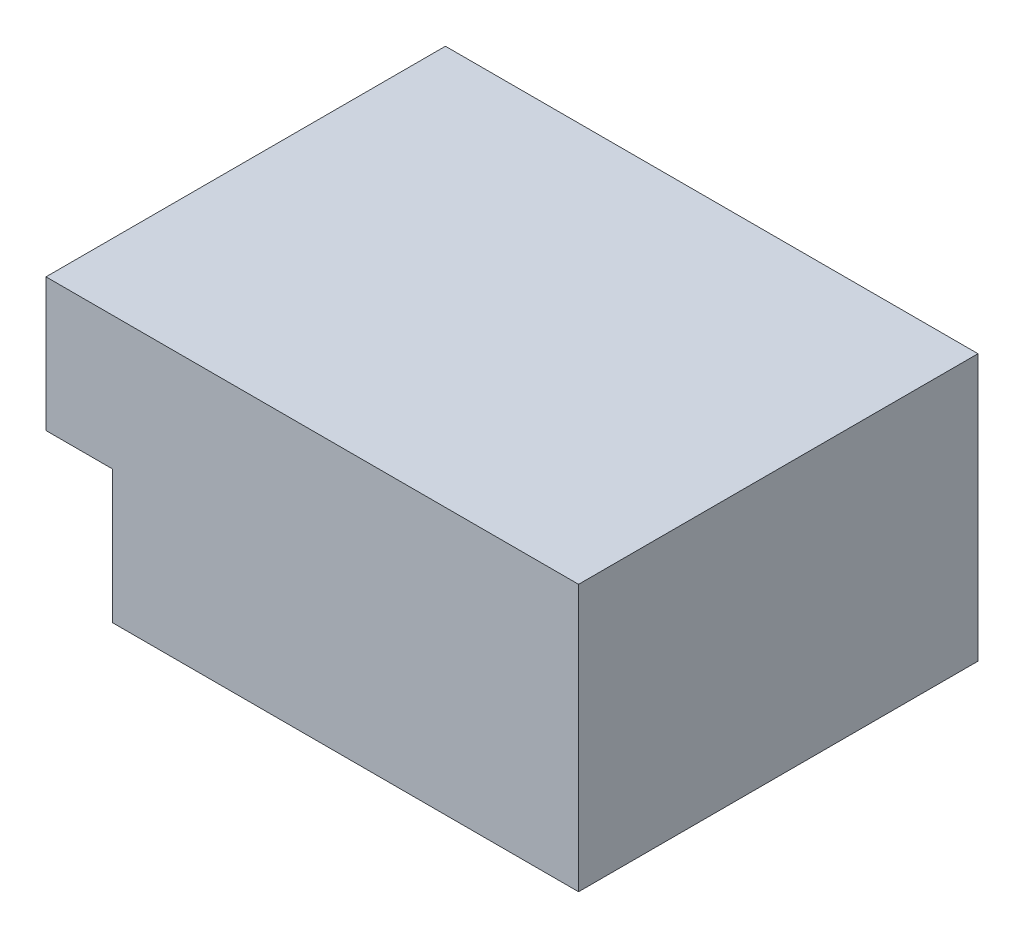
ISO-10303-21;
HEADER;
FILE_DESCRIPTION(('STEP AP214'),'2;1');
FILE_NAME('part.step','',(''),(''),'','','');
FILE_SCHEMA(('AUTOMOTIVE_DESIGN { 1 0 10303 214 1 1 1 1 }'));
ENDSEC;
DATA;
#1=APPLICATION_CONTEXT('core data for automotive mechanical design processes');
#2=APPLICATION_PROTOCOL_DEFINITION('international standard','automotive_design',2000,#1);
#3=PRODUCT_CONTEXT('',#1,'mechanical');
#4=PRODUCT('Part','Part','',(#3));
#5=PRODUCT_RELATED_PRODUCT_CATEGORY('part','',(#4));
#6=PRODUCT_DEFINITION_FORMATION('','',#4);
#7=PRODUCT_DEFINITION_CONTEXT('part definition',#1,'design');
#8=PRODUCT_DEFINITION('design','',#6,#7);
#9=PRODUCT_DEFINITION_SHAPE('','',#8);
#10=(LENGTH_UNIT() NAMED_UNIT(*) SI_UNIT(.MILLI.,.METRE.));
#11=(NAMED_UNIT(*) PLANE_ANGLE_UNIT() SI_UNIT($,.RADIAN.));
#12=(NAMED_UNIT(*) SI_UNIT($,.STERADIAN.) SOLID_ANGLE_UNIT());
#13=UNCERTAINTY_MEASURE_WITH_UNIT(LENGTH_MEASURE(1.E-05),#10,'distance_accuracy_value','');
#14=(GEOMETRIC_REPRESENTATION_CONTEXT(3) GLOBAL_UNCERTAINTY_ASSIGNED_CONTEXT((#13)) GLOBAL_UNIT_ASSIGNED_CONTEXT((#10,
#11,#12)) REPRESENTATION_CONTEXT('',''));
#15=CARTESIAN_POINT('',(0.,0.,0.));
#16=DIRECTION('',(0.,0.,1.));
#17=DIRECTION('',(1.,0.,0.));
#18=AXIS2_PLACEMENT_3D('',#15,#16,#17);
#19=CARTESIAN_POINT('',(0.,0.,0.));
#20=DIRECTION('',(0.,-1.,0.));
#21=DIRECTION('',(-1.,0.,0.));
#22=AXIS2_PLACEMENT_3D('',#19,#20,#21);
#23=PLANE('',#22);
#24=DIRECTION('',(0.,0.,-1.));
#25=VECTOR('',#24,1.);
#26=CARTESIAN_POINT('',(-1.95,0.,-0.25));
#27=LINE('',#26,#25);
#28=CARTESIAN_POINT('',(-1.95,0.,-0.25));
#29=VERTEX_POINT('',#28);
#30=CARTESIAN_POINT('',(-1.95,0.,-0.55));
#31=VERTEX_POINT('',#30);
#32=EDGE_CURVE('E11',#29,#31,#27,.T.);
#33=ORIENTED_EDGE('',*,*,#32,.T.);
#34=DIRECTION('',(1.,0.,0.));
#35=VECTOR('',#34,1.);
#36=CARTESIAN_POINT('',(-1.95,0.,-0.55));
#37=LINE('',#36,#35);
#38=CARTESIAN_POINT('',(-1.6,0.,-0.55));
#39=VERTEX_POINT('',#38);
#40=EDGE_CURVE('E115',#31,#39,#37,.T.);
#41=ORIENTED_EDGE('',*,*,#40,.T.);
#42=DIRECTION('',(0.,0.,-1.));
#43=VECTOR('',#42,1.);
#44=CARTESIAN_POINT('',(-1.6,0.,-0.25));
#45=LINE('',#44,#43);
#46=CARTESIAN_POINT('',(-1.6,0.,-0.25));
#47=VERTEX_POINT('',#46);
#48=EDGE_CURVE('E109',#47,#39,#45,.T.);
#49=ORIENTED_EDGE('',*,*,#48,.F.);
#50=DIRECTION('',(-1.,0.,0.));
#51=VECTOR('',#50,1.);
#52=CARTESIAN_POINT('',(-1.6,0.,-0.25));
#53=LINE('',#52,#51);
#54=EDGE_CURVE('E101',#47,#29,#53,.T.);
#55=ORIENTED_EDGE('',*,*,#54,.T.);
#56=EDGE_LOOP('',(#33,#41,#49,#55));
#57=FACE_BOUND('',#56,.T.);
#58=ADVANCED_FACE('F17',(#57),#23,.T.);
#59=CARTESIAN_POINT('',(-1.75,0.,-0.25));
#60=DIRECTION('',(0.,0.,-1.));
#61=DIRECTION('',(-1.,0.,0.));
#62=AXIS2_PLACEMENT_3D('',#59,#60,#61);
#63=PLANE('',#62);
#64=DIRECTION('',(0.,1.,0.));
#65=VECTOR('',#64,1.);
#66=CARTESIAN_POINT('',(-2.,0.1,-0.25));
#67=LINE('',#66,#65);
#68=CARTESIAN_POINT('',(-2.,0.1,-0.25));
#69=VERTEX_POINT('',#68);
#70=CARTESIAN_POINT('',(-2.,0.2,-0.25));
#71=VERTEX_POINT('',#70);
#72=EDGE_CURVE('E24',#69,#71,#67,.T.);
#73=ORIENTED_EDGE('',*,*,#72,.F.);
#74=DIRECTION('',(1.,0.,0.));
#75=VECTOR('',#74,1.);
#76=CARTESIAN_POINT('',(-2.,0.1,-0.25));
#77=LINE('',#76,#75);
#78=CARTESIAN_POINT('',(-1.95,0.1,-0.25));
#79=VERTEX_POINT('',#78);
#80=EDGE_CURVE('E85',#69,#79,#77,.T.);
#81=ORIENTED_EDGE('',*,*,#80,.T.);
#82=DIRECTION('',(0.,1.,0.));
#83=VECTOR('',#82,1.);
#84=CARTESIAN_POINT('',(-1.95,0.,-0.25));
#85=LINE('',#84,#83);
#86=EDGE_CURVE('E103',#29,#79,#85,.T.);
#87=ORIENTED_EDGE('',*,*,#86,.F.);
#88=ORIENTED_EDGE('',*,*,#54,.F.);
#89=DIRECTION('',(0.,1.,0.));
#90=VECTOR('',#89,1.);
#91=CARTESIAN_POINT('',(-1.6,0.,-0.25));
#92=LINE('',#91,#90);
#93=CARTESIAN_POINT('',(-1.6,0.2,-0.25));
#94=VERTEX_POINT('',#93);
#95=EDGE_CURVE('E80',#47,#94,#92,.T.);
#96=ORIENTED_EDGE('',*,*,#95,.T.);
#97=DIRECTION('',(-1.,0.,0.));
#98=VECTOR('',#97,1.);
#99=CARTESIAN_POINT('',(-1.6,0.2,-0.25));
#100=LINE('',#99,#98);
#101=EDGE_CURVE('E79',#94,#71,#100,.T.);
#102=ORIENTED_EDGE('',*,*,#101,.T.);
#103=EDGE_LOOP('',(#73,#81,#87,#88,#96,#102));
#104=FACE_BOUND('',#103,.T.);
#105=ADVANCED_FACE('F117',(#104),#63,.F.);
#106=CARTESIAN_POINT('',(0.,0.2,0.));
#107=DIRECTION('',(0.,-1.,0.));
#108=DIRECTION('',(-1.,0.,0.));
#109=AXIS2_PLACEMENT_3D('',#106,#107,#108);
#110=PLANE('',#109);
#111=DIRECTION('',(1.,0.,0.));
#112=VECTOR('',#111,1.);
#113=CARTESIAN_POINT('',(-2.,0.2,-0.55));
#114=LINE('',#113,#112);
#115=CARTESIAN_POINT('',(-2.,0.2,-0.55));
#116=VERTEX_POINT('',#115);
#117=CARTESIAN_POINT('',(-1.6,0.2,-0.55));
#118=VERTEX_POINT('',#117);
#119=EDGE_CURVE('E113',#116,#118,#114,.T.);
#120=ORIENTED_EDGE('',*,*,#119,.F.);
#121=DIRECTION('',(0.,0.,-1.));
#122=VECTOR('',#121,1.);
#123=CARTESIAN_POINT('',(-2.,0.2,-0.25));
#124=LINE('',#123,#122);
#125=EDGE_CURVE('E91',#71,#116,#124,.T.);
#126=ORIENTED_EDGE('',*,*,#125,.F.);
#127=ORIENTED_EDGE('',*,*,#101,.F.);
#128=DIRECTION('',(0.,0.,1.));
#129=VECTOR('',#128,1.);
#130=CARTESIAN_POINT('',(-1.6,0.2,-0.55));
#131=LINE('',#130,#129);
#132=EDGE_CURVE('E98',#118,#94,#131,.T.);
#133=ORIENTED_EDGE('',*,*,#132,.F.);
#134=EDGE_LOOP('',(#120,#126,#127,#133));
#135=FACE_BOUND('',#134,.T.);
#136=ADVANCED_FACE('F122',(#135),#110,.F.);
#137=CARTESIAN_POINT('',(-1.6,0.,-0.25));
#138=DIRECTION('',(1.,0.,0.));
#139=DIRECTION('',(0.,0.,-1.));
#140=AXIS2_PLACEMENT_3D('',#137,#138,#139);
#141=PLANE('',#140);
#142=DIRECTION('',(0.,1.,0.));
#143=VECTOR('',#142,1.);
#144=CARTESIAN_POINT('',(-1.6,0.,-0.55));
#145=LINE('',#144,#143);
#146=EDGE_CURVE('E107',#39,#118,#145,.T.);
#147=ORIENTED_EDGE('',*,*,#146,.T.);
#148=ORIENTED_EDGE('',*,*,#132,.T.);
#149=ORIENTED_EDGE('',*,*,#95,.F.);
#150=ORIENTED_EDGE('',*,*,#48,.T.);
#151=EDGE_LOOP('',(#147,#148,#149,#150));
#152=FACE_BOUND('',#151,.T.);
#153=ADVANCED_FACE('F125',(#152),#141,.T.);
#154=CARTESIAN_POINT('',(-2.,0.,-0.55));
#155=DIRECTION('',(0.,0.,1.));
#156=DIRECTION('',(1.,0.,0.));
#157=AXIS2_PLACEMENT_3D('',#154,#155,#156);
#158=PLANE('',#157);
#159=DIRECTION('',(0.,1.,0.));
#160=VECTOR('',#159,1.);
#161=CARTESIAN_POINT('',(-1.95,0.,-0.55));
#162=LINE('',#161,#160);
#163=CARTESIAN_POINT('',(-1.95,0.1,-0.55));
#164=VERTEX_POINT('',#163);
#165=EDGE_CURVE('E75',#31,#164,#162,.T.);
#166=ORIENTED_EDGE('',*,*,#165,.T.);
#167=DIRECTION('',(1.,0.,0.));
#168=VECTOR('',#167,1.);
#169=CARTESIAN_POINT('',(-2.,0.1,-0.55));
#170=LINE('',#169,#168);
#171=CARTESIAN_POINT('',(-2.,0.1,-0.55));
#172=VERTEX_POINT('',#171);
#173=EDGE_CURVE('E68',#172,#164,#170,.T.);
#174=ORIENTED_EDGE('',*,*,#173,.F.);
#175=DIRECTION('',(0.,1.,0.));
#176=VECTOR('',#175,1.);
#177=CARTESIAN_POINT('',(-2.,0.1,-0.55));
#178=LINE('',#177,#176);
#179=EDGE_CURVE('E73',#172,#116,#178,.T.);
#180=ORIENTED_EDGE('',*,*,#179,.T.);
#181=ORIENTED_EDGE('',*,*,#119,.T.);
#182=ORIENTED_EDGE('',*,*,#146,.F.);
#183=ORIENTED_EDGE('',*,*,#40,.F.);
#184=EDGE_LOOP('',(#166,#174,#180,#181,#182,#183));
#185=FACE_BOUND('',#184,.T.);
#186=ADVANCED_FACE('F70',(#185),#158,.F.);
#187=CARTESIAN_POINT('',(-2.,0.,-0.25));
#188=DIRECTION('',(1.,0.,0.));
#189=DIRECTION('',(0.,0.,-1.));
#190=AXIS2_PLACEMENT_3D('',#187,#188,#189);
#191=PLANE('',#190);
#192=ORIENTED_EDGE('',*,*,#72,.T.);
#193=ORIENTED_EDGE('',*,*,#125,.T.);
#194=ORIENTED_EDGE('',*,*,#179,.F.);
#195=DIRECTION('',(0.,0.,-1.));
#196=VECTOR('',#195,1.);
#197=CARTESIAN_POINT('',(-2.,0.1,-0.25));
#198=LINE('',#197,#196);
#199=EDGE_CURVE('E83',#69,#172,#198,.T.);
#200=ORIENTED_EDGE('',*,*,#199,.F.);
#201=EDGE_LOOP('',(#192,#193,#194,#200));
#202=FACE_BOUND('',#201,.T.);
#203=ADVANCED_FACE('F90',(#202),#191,.F.);
#204=CARTESIAN_POINT('',(-2.,0.1,-1.92));
#205=DIRECTION('',(0.,-1.,0.));
#206=DIRECTION('',(1.,0.,0.));
#207=AXIS2_PLACEMENT_3D('',#204,#205,#206);
#208=PLANE('',#207);
#209=ORIENTED_EDGE('',*,*,#80,.F.);
#210=ORIENTED_EDGE('',*,*,#199,.T.);
#211=ORIENTED_EDGE('',*,*,#173,.T.);
#212=DIRECTION('',(0.,0.,1.));
#213=VECTOR('',#212,1.);
#214=CARTESIAN_POINT('',(-1.95,0.1,-0.55));
#215=LINE('',#214,#213);
#216=EDGE_CURVE('E87',#164,#79,#215,.T.);
#217=ORIENTED_EDGE('',*,*,#216,.T.);
#218=EDGE_LOOP('',(#209,#210,#211,#217));
#219=FACE_BOUND('',#218,.T.);
#220=ADVANCED_FACE('F84',(#219),#208,.T.);
#221=CARTESIAN_POINT('',(-1.95,0.1,-1.92));
#222=DIRECTION('',(-1.,0.,0.));
#223=DIRECTION('',(0.,-1.,0.));
#224=AXIS2_PLACEMENT_3D('',#221,#222,#223);
#225=PLANE('',#224);
#226=ORIENTED_EDGE('',*,*,#165,.F.);
#227=ORIENTED_EDGE('',*,*,#32,.F.);
#228=ORIENTED_EDGE('',*,*,#86,.T.);
#229=ORIENTED_EDGE('',*,*,#216,.F.);
#230=EDGE_LOOP('',(#226,#227,#228,#229));
#231=FACE_BOUND('',#230,.T.);
#232=ADVANCED_FACE('F127',(#231),#225,.T.);
#233=CLOSED_SHELL('',(#58,#105,#136,#153,#186,#203,#220,#232));
#234=MANIFOLD_SOLID_BREP('B1',#233);
#235=ADVANCED_BREP_SHAPE_REPRESENTATION('',(#18,#234),#14);
#236=SHAPE_DEFINITION_REPRESENTATION(#9,#235);
ENDSEC;
END-ISO-10303-21;
